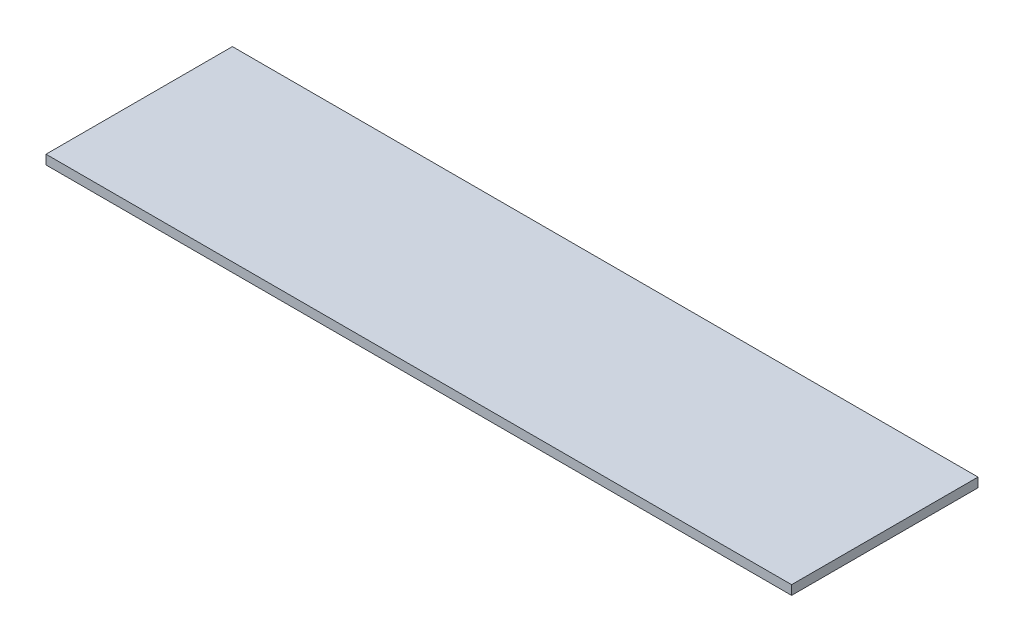
ISO-10303-21;
HEADER;
FILE_DESCRIPTION(('STEP AP214'),'2;1');
FILE_NAME('part.step','',(''),(''),'','','');
FILE_SCHEMA(('AUTOMOTIVE_DESIGN { 1 0 10303 214 1 1 1 1 }'));
ENDSEC;
DATA;
#1=APPLICATION_CONTEXT('core data for automotive mechanical design processes');
#2=APPLICATION_PROTOCOL_DEFINITION('international standard','automotive_design',2000,#1);
#3=PRODUCT_CONTEXT('',#1,'mechanical');
#4=PRODUCT('Part','Part','',(#3));
#5=PRODUCT_RELATED_PRODUCT_CATEGORY('part','',(#4));
#6=PRODUCT_DEFINITION_FORMATION('','',#4);
#7=PRODUCT_DEFINITION_CONTEXT('part definition',#1,'design');
#8=PRODUCT_DEFINITION('design','',#6,#7);
#9=PRODUCT_DEFINITION_SHAPE('','',#8);
#10=(LENGTH_UNIT() NAMED_UNIT(*) SI_UNIT(.MILLI.,.METRE.));
#11=(NAMED_UNIT(*) PLANE_ANGLE_UNIT() SI_UNIT($,.RADIAN.));
#12=(NAMED_UNIT(*) SI_UNIT($,.STERADIAN.) SOLID_ANGLE_UNIT());
#13=UNCERTAINTY_MEASURE_WITH_UNIT(LENGTH_MEASURE(1.E-05),#10,'distance_accuracy_value','');
#14=(GEOMETRIC_REPRESENTATION_CONTEXT(3) GLOBAL_UNCERTAINTY_ASSIGNED_CONTEXT((#13)) GLOBAL_UNIT_ASSIGNED_CONTEXT((#10,
#11,#12)) REPRESENTATION_CONTEXT('',''));
#15=CARTESIAN_POINT('',(0.,0.,0.));
#16=DIRECTION('',(0.,0.,1.));
#17=DIRECTION('',(1.,0.,0.));
#18=AXIS2_PLACEMENT_3D('',#15,#16,#17);
#19=CARTESIAN_POINT('',(-40.,1.,10.));
#20=DIRECTION('',(-1.,0.,0.));
#21=DIRECTION('',(0.,0.,1.));
#22=AXIS2_PLACEMENT_3D('',#19,#20,#21);
#23=PLANE('',#22);
#24=DIRECTION('',(0.,0.,-1.));
#25=VECTOR('',#24,1.);
#26=CARTESIAN_POINT('',(-40.,0.,10.));
#27=LINE('',#26,#25);
#28=CARTESIAN_POINT('',(-40.,0.,10.));
#29=VERTEX_POINT('',#28);
#30=CARTESIAN_POINT('',(-40.,0.,-10.));
#31=VERTEX_POINT('',#30);
#32=EDGE_CURVE('E98',#29,#31,#27,.T.);
#33=ORIENTED_EDGE('',*,*,#32,.F.);
#34=DIRECTION('',(0.,-1.,0.));
#35=VECTOR('',#34,1.);
#36=CARTESIAN_POINT('',(-40.,1.,10.));
#37=LINE('',#36,#35);
#38=CARTESIAN_POINT('',(-40.,1.,10.));
#39=VERTEX_POINT('',#38);
#40=EDGE_CURVE('E11',#39,#29,#37,.T.);
#41=ORIENTED_EDGE('',*,*,#40,.F.);
#42=DIRECTION('',(0.,0.,-1.));
#43=VECTOR('',#42,1.);
#44=CARTESIAN_POINT('',(-40.,1.,10.));
#45=LINE('',#44,#43);
#46=CARTESIAN_POINT('',(-40.,1.,-10.));
#47=VERTEX_POINT('',#46);
#48=EDGE_CURVE('E93',#39,#47,#45,.T.);
#49=ORIENTED_EDGE('',*,*,#48,.T.);
#50=DIRECTION('',(0.,-1.,0.));
#51=VECTOR('',#50,1.);
#52=CARTESIAN_POINT('',(-40.,1.,-10.));
#53=LINE('',#52,#51);
#54=EDGE_CURVE('E36',#47,#31,#53,.T.);
#55=ORIENTED_EDGE('',*,*,#54,.T.);
#56=EDGE_LOOP('',(#33,#41,#49,#55));
#57=FACE_BOUND('',#56,.T.);
#58=ADVANCED_FACE('F33',(#57),#23,.T.);
#59=CARTESIAN_POINT('',(-40.,1.,10.));
#60=DIRECTION('',(0.,0.,-1.));
#61=DIRECTION('',(-1.,0.,0.));
#62=AXIS2_PLACEMENT_3D('',#59,#60,#61);
#63=PLANE('',#62);
#64=DIRECTION('',(1.,0.,0.));
#65=VECTOR('',#64,1.);
#66=CARTESIAN_POINT('',(-40.,0.,10.));
#67=LINE('',#66,#65);
#68=CARTESIAN_POINT('',(40.,0.,10.));
#69=VERTEX_POINT('',#68);
#70=EDGE_CURVE('E66',#29,#69,#67,.T.);
#71=ORIENTED_EDGE('',*,*,#70,.T.);
#72=DIRECTION('',(0.,-1.,0.));
#73=VECTOR('',#72,1.);
#74=CARTESIAN_POINT('',(40.,1.,10.));
#75=LINE('',#74,#73);
#76=CARTESIAN_POINT('',(40.,1.,10.));
#77=VERTEX_POINT('',#76);
#78=EDGE_CURVE('E42',#77,#69,#75,.T.);
#79=ORIENTED_EDGE('',*,*,#78,.F.);
#80=DIRECTION('',(1.,0.,0.));
#81=VECTOR('',#80,1.);
#82=CARTESIAN_POINT('',(-40.,1.,10.));
#83=LINE('',#82,#81);
#84=EDGE_CURVE('E83',#39,#77,#83,.T.);
#85=ORIENTED_EDGE('',*,*,#84,.F.);
#86=ORIENTED_EDGE('',*,*,#40,.T.);
#87=EDGE_LOOP('',(#71,#79,#85,#86));
#88=FACE_BOUND('',#87,.T.);
#89=ADVANCED_FACE('F108',(#88),#63,.F.);
#90=CARTESIAN_POINT('',(40.,1.,10.));
#91=DIRECTION('',(-1.,0.,0.));
#92=DIRECTION('',(0.,0.,1.));
#93=AXIS2_PLACEMENT_3D('',#90,#91,#92);
#94=PLANE('',#93);
#95=DIRECTION('',(0.,0.,-1.));
#96=VECTOR('',#95,1.);
#97=CARTESIAN_POINT('',(40.,0.,10.));
#98=LINE('',#97,#96);
#99=CARTESIAN_POINT('',(40.,0.,-10.));
#100=VERTEX_POINT('',#99);
#101=EDGE_CURVE('E90',#69,#100,#98,.T.);
#102=ORIENTED_EDGE('',*,*,#101,.T.);
#103=DIRECTION('',(0.,-1.,0.));
#104=VECTOR('',#103,1.);
#105=CARTESIAN_POINT('',(40.,1.,-10.));
#106=LINE('',#105,#104);
#107=CARTESIAN_POINT('',(40.,1.,-10.));
#108=VERTEX_POINT('',#107);
#109=EDGE_CURVE('E87',#108,#100,#106,.T.);
#110=ORIENTED_EDGE('',*,*,#109,.F.);
#111=DIRECTION('',(0.,0.,-1.));
#112=VECTOR('',#111,1.);
#113=CARTESIAN_POINT('',(40.,1.,10.));
#114=LINE('',#113,#112);
#115=EDGE_CURVE('E78',#77,#108,#114,.T.);
#116=ORIENTED_EDGE('',*,*,#115,.F.);
#117=ORIENTED_EDGE('',*,*,#78,.T.);
#118=EDGE_LOOP('',(#102,#110,#116,#117));
#119=FACE_BOUND('',#118,.T.);
#120=ADVANCED_FACE('F88',(#119),#94,.F.);
#121=CARTESIAN_POINT('',(-40.,1.,-10.));
#122=DIRECTION('',(0.,0.,-1.));
#123=DIRECTION('',(-1.,0.,0.));
#124=AXIS2_PLACEMENT_3D('',#121,#122,#123);
#125=PLANE('',#124);
#126=DIRECTION('',(1.,0.,0.));
#127=VECTOR('',#126,1.);
#128=CARTESIAN_POINT('',(-40.,0.,-10.));
#129=LINE('',#128,#127);
#130=EDGE_CURVE('E101',#31,#100,#129,.T.);
#131=ORIENTED_EDGE('',*,*,#130,.F.);
#132=ORIENTED_EDGE('',*,*,#54,.F.);
#133=DIRECTION('',(1.,0.,0.));
#134=VECTOR('',#133,1.);
#135=CARTESIAN_POINT('',(-40.,1.,-10.));
#136=LINE('',#135,#134);
#137=EDGE_CURVE('E82',#47,#108,#136,.T.);
#138=ORIENTED_EDGE('',*,*,#137,.T.);
#139=ORIENTED_EDGE('',*,*,#109,.T.);
#140=EDGE_LOOP('',(#131,#132,#138,#139));
#141=FACE_BOUND('',#140,.T.);
#142=ADVANCED_FACE('F92',(#141),#125,.T.);
#143=CARTESIAN_POINT('',(0.,1.,0.));
#144=DIRECTION('',(0.,-1.,0.));
#145=DIRECTION('',(0.,0.,-1.));
#146=AXIS2_PLACEMENT_3D('',#143,#144,#145);
#147=PLANE('',#146);
#148=ORIENTED_EDGE('',*,*,#48,.F.);
#149=ORIENTED_EDGE('',*,*,#84,.T.);
#150=ORIENTED_EDGE('',*,*,#115,.T.);
#151=ORIENTED_EDGE('',*,*,#137,.F.);
#152=EDGE_LOOP('',(#148,#149,#150,#151));
#153=FACE_BOUND('',#152,.T.);
#154=ADVANCED_FACE('F81',(#153),#147,.F.);
#155=CARTESIAN_POINT('',(0.,0.,0.));
#156=DIRECTION('',(0.,-1.,0.));
#157=DIRECTION('',(0.,0.,-1.));
#158=AXIS2_PLACEMENT_3D('',#155,#156,#157);
#159=PLANE('',#158);
#160=ORIENTED_EDGE('',*,*,#32,.T.);
#161=ORIENTED_EDGE('',*,*,#130,.T.);
#162=ORIENTED_EDGE('',*,*,#101,.F.);
#163=ORIENTED_EDGE('',*,*,#70,.F.);
#164=EDGE_LOOP('',(#160,#161,#162,#163));
#165=FACE_BOUND('',#164,.T.);
#166=ADVANCED_FACE('F106',(#165),#159,.T.);
#167=CLOSED_SHELL('',(#58,#89,#120,#142,#154,#166));
#168=MANIFOLD_SOLID_BREP('B2',#167);
#169=ADVANCED_BREP_SHAPE_REPRESENTATION('',(#18,#168),#14);
#170=SHAPE_DEFINITION_REPRESENTATION(#9,#169);
ENDSEC;
END-ISO-10303-21;
